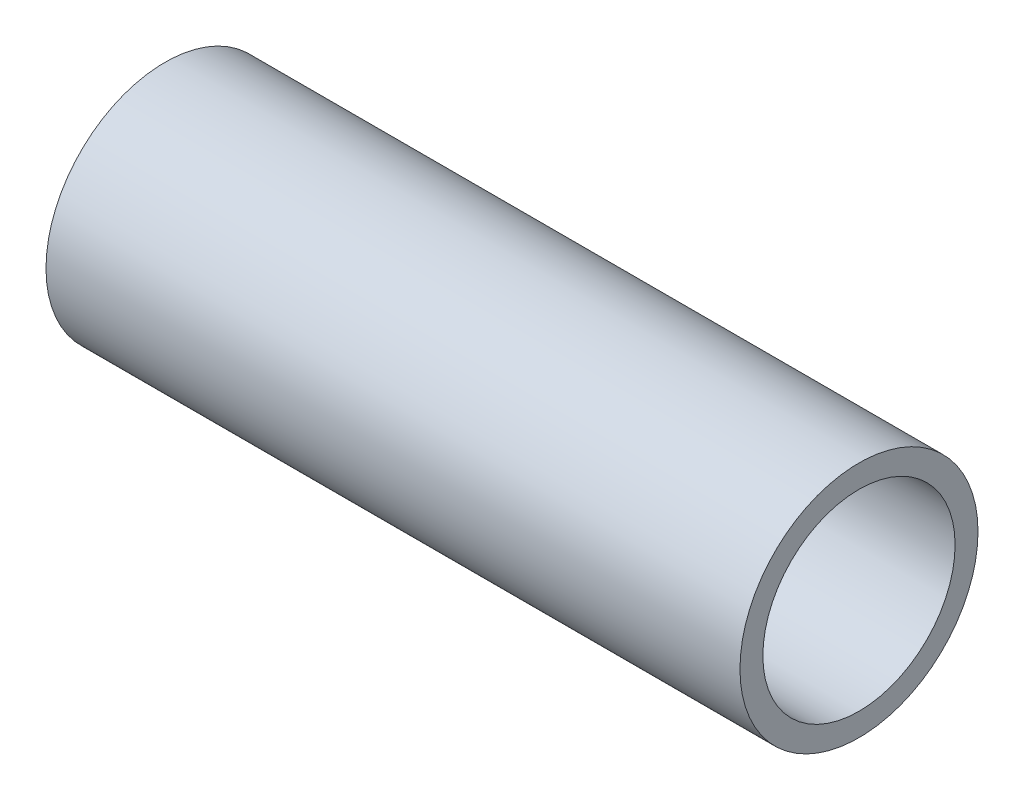
ISO-10303-21;
HEADER;
FILE_DESCRIPTION(('STEP AP214'),'2;1');
FILE_NAME('part.step','',(''),(''),'','','');
FILE_SCHEMA(('AUTOMOTIVE_DESIGN { 1 0 10303 214 1 1 1 1 }'));
ENDSEC;
DATA;
#1=APPLICATION_CONTEXT('core data for automotive mechanical design processes');
#2=APPLICATION_PROTOCOL_DEFINITION('international standard','automotive_design',2000,#1);
#3=PRODUCT_CONTEXT('',#1,'mechanical');
#4=PRODUCT('Part','Part','',(#3));
#5=PRODUCT_RELATED_PRODUCT_CATEGORY('part','',(#4));
#6=PRODUCT_DEFINITION_FORMATION('','',#4);
#7=PRODUCT_DEFINITION_CONTEXT('part definition',#1,'design');
#8=PRODUCT_DEFINITION('design','',#6,#7);
#9=PRODUCT_DEFINITION_SHAPE('','',#8);
#10=(LENGTH_UNIT() NAMED_UNIT(*) SI_UNIT(.MILLI.,.METRE.));
#11=(NAMED_UNIT(*) PLANE_ANGLE_UNIT() SI_UNIT($,.RADIAN.));
#12=(NAMED_UNIT(*) SI_UNIT($,.STERADIAN.) SOLID_ANGLE_UNIT());
#13=UNCERTAINTY_MEASURE_WITH_UNIT(LENGTH_MEASURE(1.E-05),#10,'distance_accuracy_value','');
#14=(GEOMETRIC_REPRESENTATION_CONTEXT(3) GLOBAL_UNCERTAINTY_ASSIGNED_CONTEXT((#13)) GLOBAL_UNIT_ASSIGNED_CONTEXT((#10,
#11,#12)) REPRESENTATION_CONTEXT('',''));
#15=CARTESIAN_POINT('',(0.,0.,0.));
#16=DIRECTION('',(0.,0.,1.));
#17=DIRECTION('',(1.,0.,0.));
#18=AXIS2_PLACEMENT_3D('',#15,#16,#17);
#19=CARTESIAN_POINT('',(28.8797999999999,0.,0.));
#20=DIRECTION('',(-1.00000000000001,0.,0.));
#21=DIRECTION('',(0.,0.,1.00000000000001));
#22=AXIS2_PLACEMENT_3D('',#19,#20,#21);
#23=CYLINDRICAL_SURFACE('',#22,4.);
#24=CARTESIAN_POINT('',(0.,0.,0.));
#25=DIRECTION('',(-1.00000000000001,0.,0.));
#26=DIRECTION('',(0.,0.,1.00000000000001));
#27=AXIS2_PLACEMENT_3D('',#24,#25,#26);
#28=CIRCLE('',#27,4.);
#29=CARTESIAN_POINT('',(0.,0.,4.00000000000005));
#30=VERTEX_POINT('',#29);
#31=EDGE_CURVE('E34',#30,#30,#28,.T.);
#32=ORIENTED_EDGE('',*,*,#31,.T.);
#33=EDGE_LOOP('',(#32));
#34=FACE_BOUND('',#33,.T.);
#35=CARTESIAN_POINT('',(28.8797999999999,0.,0.));
#36=DIRECTION('',(-1.00000000000001,0.,0.));
#37=DIRECTION('',(0.,0.,1.00000000000001));
#38=AXIS2_PLACEMENT_3D('',#35,#36,#37);
#39=CIRCLE('',#38,4.);
#40=CARTESIAN_POINT('',(28.8797999999999,0.,4.00000000000005));
#41=VERTEX_POINT('',#40);
#42=EDGE_CURVE('E25',#41,#41,#39,.T.);
#43=ORIENTED_EDGE('',*,*,#42,.F.);
#44=EDGE_LOOP('',(#43));
#45=FACE_BOUND('',#44,.T.);
#46=ADVANCED_FACE('F22',(#34,#45),#23,.F.);
#47=CARTESIAN_POINT('',(28.8797999999999,0.,0.));
#48=DIRECTION('',(1.00000000000001,0.,0.));
#49=DIRECTION('',(0.,0.,-1.00000000000001));
#50=AXIS2_PLACEMENT_3D('',#47,#48,#49);
#51=PLANE('',#50);
#52=ORIENTED_EDGE('',*,*,#42,.T.);
#53=EDGE_LOOP('',(#52));
#54=FACE_BOUND('',#53,.T.);
#55=CARTESIAN_POINT('',(28.8797999999999,0.,0.));
#56=DIRECTION('',(-1.00000000000001,0.,0.));
#57=DIRECTION('',(0.,0.,1.00000000000001));
#58=AXIS2_PLACEMENT_3D('',#55,#56,#57);
#59=CIRCLE('',#58,4.953);
#60=CARTESIAN_POINT('',(28.8797999999999,0.,4.95300000000007));
#61=VERTEX_POINT('',#60);
#62=EDGE_CURVE('E29',#61,#61,#59,.T.);
#63=ORIENTED_EDGE('',*,*,#62,.F.);
#64=EDGE_LOOP('',(#63));
#65=FACE_BOUND('',#64,.T.);
#66=ADVANCED_FACE('F42',(#54,#65),#51,.T.);
#67=CARTESIAN_POINT('',(0.,0.,0.));
#68=DIRECTION('',(1.00000000000001,0.,0.));
#69=DIRECTION('',(0.,0.,-1.00000000000001));
#70=AXIS2_PLACEMENT_3D('',#67,#68,#69);
#71=PLANE('',#70);
#72=ORIENTED_EDGE('',*,*,#31,.F.);
#73=EDGE_LOOP('',(#72));
#74=FACE_BOUND('',#73,.T.);
#75=CARTESIAN_POINT('',(0.,0.,0.));
#76=DIRECTION('',(-1.00000000000001,0.,0.));
#77=DIRECTION('',(0.,0.,1.00000000000001));
#78=AXIS2_PLACEMENT_3D('',#75,#76,#77);
#79=CIRCLE('',#78,4.953);
#80=CARTESIAN_POINT('',(0.,0.,4.95300000000007));
#81=VERTEX_POINT('',#80);
#82=EDGE_CURVE('E12',#81,#81,#79,.F.);
#83=ORIENTED_EDGE('',*,*,#82,.F.);
#84=EDGE_LOOP('',(#83));
#85=FACE_BOUND('',#84,.T.);
#86=ADVANCED_FACE('F50',(#74,#85),#71,.F.);
#87=CARTESIAN_POINT('',(28.8797999999999,0.,0.));
#88=DIRECTION('',(-1.00000000000001,0.,0.));
#89=DIRECTION('',(0.,0.,1.00000000000001));
#90=AXIS2_PLACEMENT_3D('',#87,#88,#89);
#91=CYLINDRICAL_SURFACE('',#90,4.953);
#92=ORIENTED_EDGE('',*,*,#82,.T.);
#93=EDGE_LOOP('',(#92));
#94=FACE_BOUND('',#93,.T.);
#95=ORIENTED_EDGE('',*,*,#62,.T.);
#96=EDGE_LOOP('',(#95));
#97=FACE_BOUND('',#96,.T.);
#98=ADVANCED_FACE('F51',(#94,#97),#91,.T.);
#99=CLOSED_SHELL('',(#46,#66,#86,#98));
#100=MANIFOLD_SOLID_BREP('B1',#99);
#101=ADVANCED_BREP_SHAPE_REPRESENTATION('',(#18,#100),#14);
#102=SHAPE_DEFINITION_REPRESENTATION(#9,#101);
ENDSEC;
END-ISO-10303-21;
